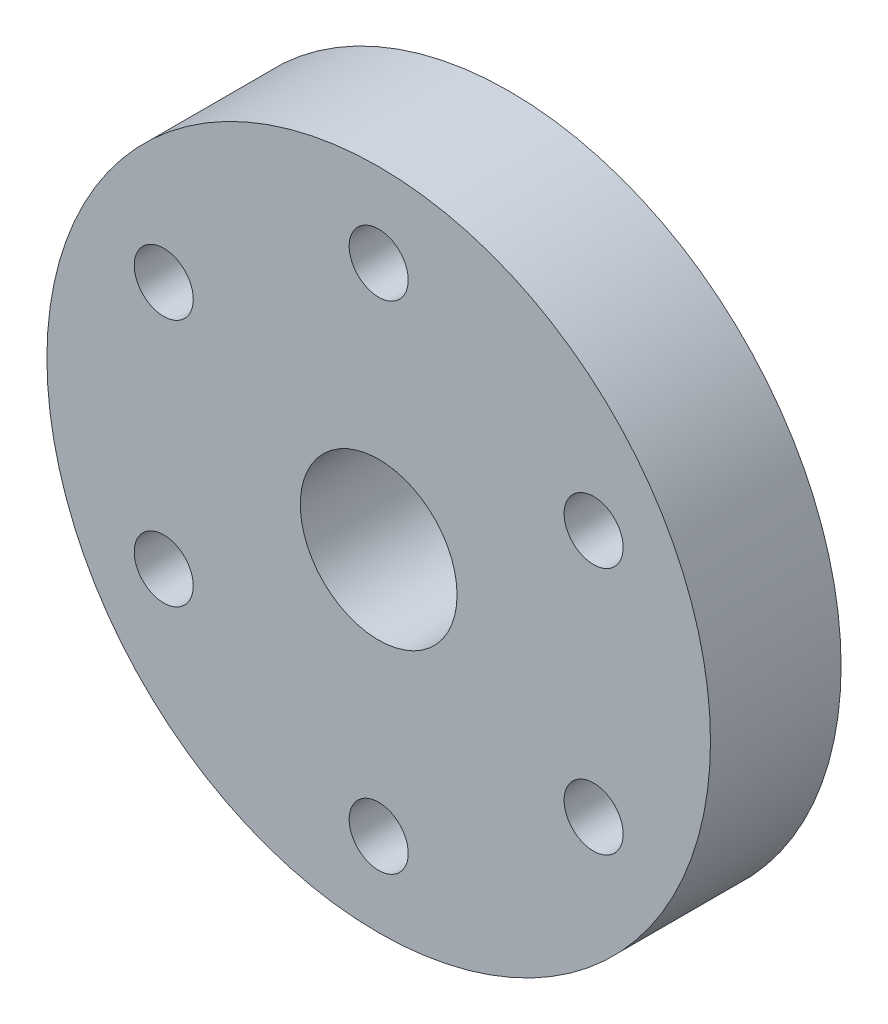
ISO-10303-21;
HEADER;
FILE_DESCRIPTION(('STEP AP214'),'2;1');
FILE_NAME('part.step','',(''),(''),'','','');
FILE_SCHEMA(('AUTOMOTIVE_DESIGN { 1 0 10303 214 1 1 1 1 }'));
ENDSEC;
DATA;
#1=APPLICATION_CONTEXT('core data for automotive mechanical design processes');
#2=APPLICATION_PROTOCOL_DEFINITION('international standard','automotive_design',2000,#1);
#3=PRODUCT_CONTEXT('',#1,'mechanical');
#4=PRODUCT('Part','Part','',(#3));
#5=PRODUCT_RELATED_PRODUCT_CATEGORY('part','',(#4));
#6=PRODUCT_DEFINITION_FORMATION('','',#4);
#7=PRODUCT_DEFINITION_CONTEXT('part definition',#1,'design');
#8=PRODUCT_DEFINITION('design','',#6,#7);
#9=PRODUCT_DEFINITION_SHAPE('','',#8);
#10=(LENGTH_UNIT() NAMED_UNIT(*) SI_UNIT(.MILLI.,.METRE.));
#11=(NAMED_UNIT(*) PLANE_ANGLE_UNIT() SI_UNIT($,.RADIAN.));
#12=(NAMED_UNIT(*) SI_UNIT($,.STERADIAN.) SOLID_ANGLE_UNIT());
#13=UNCERTAINTY_MEASURE_WITH_UNIT(LENGTH_MEASURE(1.E-05),#10,'distance_accuracy_value','');
#14=(GEOMETRIC_REPRESENTATION_CONTEXT(3) GLOBAL_UNCERTAINTY_ASSIGNED_CONTEXT((#13)) GLOBAL_UNIT_ASSIGNED_CONTEXT((#10,
#11,#12)) REPRESENTATION_CONTEXT('',''));
#15=CARTESIAN_POINT('',(0.,0.,0.));
#16=DIRECTION('',(0.,0.,1.));
#17=DIRECTION('',(1.,0.,0.));
#18=AXIS2_PLACEMENT_3D('',#15,#16,#17);
#19=CARTESIAN_POINT('',(0.,0.,0.));
#20=DIRECTION('',(0.,0.,1.));
#21=DIRECTION('',(1.,0.,0.));
#22=AXIS2_PLACEMENT_3D('',#19,#20,#21);
#23=PLANE('',#22);
#24=CARTESIAN_POINT('',(0.,0.,0.));
#25=DIRECTION('',(0.,0.,1.));
#26=DIRECTION('',(1.,0.,0.));
#27=AXIS2_PLACEMENT_3D('',#24,#25,#26);
#28=CIRCLE('',#27,6.);
#29=CARTESIAN_POINT('',(6.,0.,0.));
#30=VERTEX_POINT('',#29);
#31=EDGE_CURVE('E46',#30,#30,#28,.T.);
#32=ORIENTED_EDGE('',*,*,#31,.F.);
#33=EDGE_LOOP('',(#32));
#34=FACE_BOUND('',#33,.T.);
#35=CARTESIAN_POINT('',(0.,0.,0.));
#36=DIRECTION('',(0.,0.,1.));
#37=DIRECTION('',(1.,0.,0.));
#38=AXIS2_PLACEMENT_3D('',#35,#36,#37);
#39=CIRCLE('',#38,3.);
#40=CARTESIAN_POINT('',(3.,0.,0.));
#41=VERTEX_POINT('',#40);
#42=EDGE_CURVE('E51',#41,#41,#39,.T.);
#43=ORIENTED_EDGE('',*,*,#42,.T.);
#44=EDGE_LOOP('',(#43));
#45=FACE_BOUND('',#44,.T.);
#46=ADVANCED_FACE('F33',(#34,#45),#23,.F.);
#47=CARTESIAN_POINT('',(0.,0.,4.2));
#48=DIRECTION('',(0.,0.,-1.));
#49=DIRECTION('',(-1.,0.,0.));
#50=AXIS2_PLACEMENT_3D('',#47,#48,#49);
#51=CYLINDRICAL_SURFACE('',#50,6.);
#52=CARTESIAN_POINT('',(0.,-6.,3.5));
#53=CARTESIAN_POINT('',(0.0775136551808606,-5.99999860462077,3.49999755049782));
#54=CARTESIAN_POINT('',(0.155055852180418,-5.99848277720663,3.49354075895642));
#55=CARTESIAN_POINT('',(0.307928711689404,-5.99258245110673,3.46791633869285));
#56=CARTESIAN_POINT('',(0.383257908738774,-5.98819609437492,3.44874047701852));
#57=CARTESIAN_POINT('',(0.529474135819814,-5.97704189804572,3.39831831024663));
#58=CARTESIAN_POINT('',(0.600366020559867,-5.97027671664972,3.3670854743364));
#59=CARTESIAN_POINT('',(0.735902456221209,-5.95509063862421,3.29348083405209));
#60=CARTESIAN_POINT('',(0.800546997673411,-5.94666973948518,3.25110901279503));
#61=CARTESIAN_POINT('',(0.922925959248793,-5.92892044055307,3.15561764001887));
#62=CARTESIAN_POINT('',(0.980531045796356,-5.91957951935363,3.10233465382949));
#63=CARTESIAN_POINT('',(1.08607323847069,-5.90112886617325,2.98688389689762));
#64=CARTESIAN_POINT('',(1.13400938392729,-5.89201915724322,2.92471524435569));
#65=CARTESIAN_POINT('',(1.21944051732307,-5.87493771504315,2.79227998295129));
#66=CARTESIAN_POINT('',(1.25679466710317,-5.86698196255307,2.72192027567549));
#67=CARTESIAN_POINT('',(1.31909703704768,-5.85329030120377,2.57570531126446));
#68=CARTESIAN_POINT('',(1.34404696295362,-5.84755408715332,2.49985081137896));
#69=CARTESIAN_POINT('',(1.38039896443522,-5.83907906254273,2.34621138233285));
#70=CARTESIAN_POINT('',(1.39203167018675,-5.83628929295491,2.26848389510077));
#71=CARTESIAN_POINT('',(1.40213672759817,-5.83387021717826,2.11213439110955));
#72=CARTESIAN_POINT('',(1.40061093007045,-5.83424046651614,2.03351250170633));
#73=CARTESIAN_POINT('',(1.38462717006806,-5.83805360607404,1.87934410285429));
#74=CARTESIAN_POINT('',(1.37044019131594,-5.84143210805626,1.80376766136065));
#75=CARTESIAN_POINT('',(1.32996743878963,-5.85077891648779,1.65609814039352));
#76=CARTESIAN_POINT('',(1.30368090292846,-5.85674738606408,1.58400528064847));
#77=CARTESIAN_POINT('',(1.23951455308861,-5.87066310630364,1.44460351510235));
#78=CARTESIAN_POINT('',(1.20153320055199,-5.87862756950202,1.37734313734968));
#79=CARTESIAN_POINT('',(1.11512658099994,-5.89562771298769,1.25005155389481));
#80=CARTESIAN_POINT('',(1.06669970611106,-5.90466355809567,1.19002146336614));
#81=CARTESIAN_POINT('',(0.959356121021581,-5.92306231054005,1.07733750874245));
#82=CARTESIAN_POINT('',(0.900209750657103,-5.93242778207154,1.02490259657541));
#83=CARTESIAN_POINT('',(0.77385399055564,-5.95022809072843,0.93065747543382));
#84=CARTESIAN_POINT('',(0.706644412992491,-5.95866290616613,0.888847514030046));
#85=CARTESIAN_POINT('',(0.565782506984416,-5.97368513329122,0.816973308242645));
#86=CARTESIAN_POINT('',(0.492113392403213,-5.98026753264178,0.786940847183003));
#87=CARTESIAN_POINT('',(0.340585615176868,-5.99080645286014,0.739744288534925));
#88=CARTESIAN_POINT('',(0.262727650306185,-5.99476340961636,0.72257805477302));
#89=CARTESIAN_POINT('',(0.106907588460029,-5.99954244402773,0.70192686366759));
#90=CARTESIAN_POINT('',(0.0289871166552413,-6.00043294383207,0.698143245718862));
#91=CARTESIAN_POINT('',(-0.126372845528744,-5.99917188382708,0.703550834630745));
#92=CARTESIAN_POINT('',(-0.203812372830682,-5.99702056051609,0.7127410327916));
#93=CARTESIAN_POINT('',(-0.355000856153422,-5.98996106858808,0.74358830502789));
#94=CARTESIAN_POINT('',(-0.428784148664062,-5.9850881879476,0.765085887975081));
#95=CARTESIAN_POINT('',(-0.571695899544112,-5.97313240187964,0.819758347367704));
#96=CARTESIAN_POINT('',(-0.640823925050002,-5.96604929128103,0.852934307929705));
#97=CARTESIAN_POINT('',(-0.773676865632761,-5.95029195840437,0.930624301545468));
#98=CARTESIAN_POINT('',(-0.837298480893235,-5.9415942435686,0.975310106522388));
#99=CARTESIAN_POINT('',(-0.956246790292011,-5.92361520942204,1.07452818776419));
#100=CARTESIAN_POINT('',(-1.01157224539757,-5.91433380323009,1.1290619321447));
#101=CARTESIAN_POINT('',(-1.11356143853837,-5.89599253653189,1.24780629554065));
#102=CARTESIAN_POINT('',(-1.16001705897302,-5.8869415232112,1.31219730279702));
#103=CARTESIAN_POINT('',(-1.24145867752415,-5.87030791238069,1.44804081164209));
#104=CARTESIAN_POINT('',(-1.27644518731706,-5.8627252493689,1.51949299802219));
#105=CARTESIAN_POINT('',(-1.33370534540389,-5.84996505463622,1.66704045999628));
#106=CARTESIAN_POINT('',(-1.35605325740337,-5.84477350703676,1.74310564180338));
#107=CARTESIAN_POINT('',(-1.38761099409425,-5.83736270589205,1.89805048375049));
#108=CARTESIAN_POINT('',(-1.39682325969457,-5.83514290013266,1.97692961819947));
#109=CARTESIAN_POINT('',(-1.40173339100697,-5.8339650668052,2.1331565495));
#110=CARTESIAN_POINT('',(-1.39776234943619,-5.83492712585111,2.21049351644876));
#111=CARTESIAN_POINT('',(-1.3771667082819,-5.83982206816926,2.36336303979087));
#112=CARTESIAN_POINT('',(-1.36054230260668,-5.84375490591537,2.43889562381744));
#113=CARTESIAN_POINT('',(-1.31528151618139,-5.85410673416447,2.58570549046038));
#114=CARTESIAN_POINT('',(-1.28669962480293,-5.86051443684696,2.65700042145178));
#115=CARTESIAN_POINT('',(-1.2183798684127,-5.87509704008543,2.79382999595179));
#116=CARTESIAN_POINT('',(-1.17864066141223,-5.88327215319622,2.85936394529051));
#117=CARTESIAN_POINT('',(-1.08806343467475,-5.90070227653374,2.98442910308178));
#118=CARTESIAN_POINT('',(-1.03699221748307,-5.9099777197338,3.04378860408992));
#119=CARTESIAN_POINT('',(-0.925665237986201,-5.92843331002946,3.15320306160817));
#120=CARTESIAN_POINT('',(-0.865407334621453,-5.93761343437582,3.20325584303191));
#121=CARTESIAN_POINT('',(-0.736311376134255,-5.95501024549108,3.29337181261718));
#122=CARTESIAN_POINT('',(-0.667356718680486,-5.96321014750897,3.33327141389703));
#123=CARTESIAN_POINT('',(-0.523538263687533,-5.97755068140178,3.40084956861957));
#124=CARTESIAN_POINT('',(-0.448679156038939,-5.98369292771758,3.42853770862458));
#125=CARTESIAN_POINT('',(-0.311528184180862,-5.99221392489556,3.46634021560558));
#126=CARTESIAN_POINT('',(-0.249940948576286,-5.99511474612675,3.47893714788107));
#127=CARTESIAN_POINT('',(-0.125575340933341,-5.99900829461443,3.49576779433718));
#128=CARTESIAN_POINT('',(-0.0627970368842883,-6.00000113045477,3.50000198444363));
#129=CARTESIAN_POINT('',(0.,-6.,3.5));
#130=B_SPLINE_CURVE_WITH_KNOTS('',3,(#52,#53,#54,#55,#56,#57,#58,#59,#60,#61,#62,#63,#64,#65,
#66,#67,#68,#69,#70,#71,#72,#73,#74,#75,#76,#77,#78,#79,#80,#81,#82,#83,#84,#85,#86,#87,#88,#89,
#90,#91,#92,#93,#94,#95,#96,#97,#98,#99,#100,#101,#102,#103,#104,#105,#106,#107,#108,#109,#110,
#111,#112,#113,#114,#115,#116,#117,#118,#119,#120,#121,#122,#123,#124,#125,#126,#127,#128,#129),
.UNSPECIFIED.,.T.,.F.,(4,2,2,2,2,2,2,2,2,2,2,2,2,2,2,2,2,2,2,2,2,2,2,2,2,2,2,2,2,2,2,2,2,2,2,2,
2,2,4),(0.,0.232310985919359,0.464772491816953,0.696975056396176,0.929177972918811,
1.16515351438317,1.4011524899667,1.64015884953452,1.87913233353337,2.11390145918228,
2.34863756386325,2.57846705193038,2.8083110177202,3.04020969694585,3.27214409771247,
3.50981031406085,3.74748206773496,3.98579087118959,4.22406009957936,4.45697708738846,
4.68987596715844,4.9198229082951,5.14979120128962,5.38341339123567,5.61707043801289,
5.85567302562694,6.09426496691076,6.33143998718595,6.5685709290746,6.79979193674362,
7.03100940110476,7.2611845077494,7.49138731145205,7.72685864048367,7.9623849328642,
8.20149492533847,8.44041686981216,8.62863237610634,8.81683717069852),.UNSPECIFIED.);
#131=CARTESIAN_POINT('',(0.,-6.,3.5));
#132=VERTEX_POINT('',#131);
#133=EDGE_CURVE('E64',#132,#132,#130,.T.);
#134=ORIENTED_EDGE('',*,*,#133,.T.);
#135=EDGE_LOOP('',(#134));
#136=FACE_BOUND('',#135,.T.);
#137=CARTESIAN_POINT('',(0.,0.,4.2));
#138=DIRECTION('',(0.,0.,1.));
#139=DIRECTION('',(1.,0.,0.));
#140=AXIS2_PLACEMENT_3D('',#137,#138,#139);
#141=CIRCLE('',#140,6.);
#142=CARTESIAN_POINT('',(6.,0.,4.2));
#143=VERTEX_POINT('',#142);
#144=EDGE_CURVE('E10',#143,#143,#141,.T.);
#145=ORIENTED_EDGE('',*,*,#144,.F.);
#146=EDGE_LOOP('',(#145));
#147=FACE_BOUND('',#146,.T.);
#148=ORIENTED_EDGE('',*,*,#31,.T.);
#149=EDGE_LOOP('',(#148));
#150=FACE_BOUND('',#149,.T.);
#151=ADVANCED_FACE('F35',(#136,#147,#150),#51,.T.);
#152=CARTESIAN_POINT('',(0.,0.,4.2));
#153=DIRECTION('',(0.,0.,-1.));
#154=DIRECTION('',(-1.,0.,0.));
#155=AXIS2_PLACEMENT_3D('',#152,#153,#154);
#156=CYLINDRICAL_SURFACE('',#155,3.);
#157=CARTESIAN_POINT('',(0.,-3.,3.5));
#158=CARTESIAN_POINT('',(0.074176014195853,-2.9999965985567,3.49999594944587));
#159=CARTESIAN_POINT('',(0.148457438343158,-2.99721866421499,3.49407017916472));
#160=CARTESIAN_POINT('',(0.294860958042639,-2.98638133101226,3.47061224072665));
#161=CARTESIAN_POINT('',(0.366977899485661,-2.97831023303417,3.45305436203902));
#162=CARTESIAN_POINT('',(0.506705207958354,-2.95773878056305,3.40714824486611));
#163=CARTESIAN_POINT('',(0.574331184032727,-2.94525483671525,3.37883995676572));
#164=CARTESIAN_POINT('',(0.703790652559756,-2.91703179641225,3.3124256993013));
#165=CARTESIAN_POINT('',(0.765625113804207,-2.90129324579851,3.27432137260479));
#166=CARTESIAN_POINT('',(0.885556018232679,-2.86703510505487,3.18700931632246));
#167=CARTESIAN_POINT('',(0.943262854198595,-2.84841047078529,3.13730816073342));
#168=CARTESIAN_POINT('',(1.04987206669058,-2.81086626705385,3.02926581284594));
#169=CARTESIAN_POINT('',(1.09876864666266,-2.79194651225135,2.97091897793868));
#170=CARTESIAN_POINT('',(1.18954928643585,-2.75454886272565,2.84265632770077));
#171=CARTESIAN_POINT('',(1.23076801131511,-2.73618026181933,2.77223417349252));
#172=CARTESIAN_POINT('',(1.30060459631542,-2.70368671328044,2.62449166583378));
#173=CARTESIAN_POINT('',(1.32923050054668,-2.68955905843085,2.54717575409304));
#174=CARTESIAN_POINT('',(1.37136389166292,-2.66831280778357,2.3922913308142));
#175=CARTESIAN_POINT('',(1.38562630954338,-2.66084688805232,2.31497798660206));
#176=CARTESIAN_POINT('',(1.4009643178012,-2.65280653141493,2.1587238445313));
#177=CARTESIAN_POINT('',(1.4020501890138,-2.65222672171534,2.07978436362683));
#178=CARTESIAN_POINT('',(1.39156325474428,-2.6577381391041,1.93104782259268));
#179=CARTESIAN_POINT('',(1.38125548710099,-2.66316277668237,1.86113132367479));
#180=CARTESIAN_POINT('',(1.35043639237287,-2.67892103840313,1.72416592160718));
#181=CARTESIAN_POINT('',(1.32992244300339,-2.68925592410991,1.65711776023274));
#182=CARTESIAN_POINT('',(1.27887161255287,-2.71390923378543,1.52592780866886));
#183=CARTESIAN_POINT('',(1.24811450695909,-2.7283140240837,1.46188869599852));
#184=CARTESIAN_POINT('',(1.17761205733664,-2.75947702819645,1.33959400364931));
#185=CARTESIAN_POINT('',(1.13786278548149,-2.77623626923161,1.28134096740936));
#186=CARTESIAN_POINT('',(1.04545769592096,-2.81242518177222,1.16561325724133));
#187=CARTESIAN_POINT('',(0.991869135627384,-2.83194722846672,1.10890981132952));
#188=CARTESIAN_POINT('',(0.875809338201001,-2.86996272516678,1.00499883889947));
#189=CARTESIAN_POINT('',(0.813334864133948,-2.88845579691007,0.957794787991446));
#190=CARTESIAN_POINT('',(0.678420066791913,-2.92314231667083,0.872674741990081));
#191=CARTESIAN_POINT('',(0.605704043903011,-2.9392303997136,0.835149439534242));
#192=CARTESIAN_POINT('',(0.454047875045107,-2.9664385628126,0.773147281488888));
#193=CARTESIAN_POINT('',(0.375112098848906,-2.97756209480586,0.748661357101825));
#194=CARTESIAN_POINT('',(0.219630179590064,-2.99289168727817,0.715224614513687));
#195=CARTESIAN_POINT('',(0.143350867486889,-2.99755511855446,0.70524384224663));
#196=CARTESIAN_POINT('',(-0.00993159603062645,-3.00096130674055,0.697936660080451));
#197=CARTESIAN_POINT('',(-0.0869344549310046,-2.99970636153703,0.700605338869388));
#198=CARTESIAN_POINT('',(-0.234138662301146,-2.99169876992405,0.717859772256281));
#199=CARTESIAN_POINT('',(-0.304455247280262,-2.98531143610107,0.731653879274028));
#200=CARTESIAN_POINT('',(-0.441661374952198,-2.9681169868393,0.769585296470063));
#201=CARTESIAN_POINT('',(-0.508550515457683,-2.95730935403885,0.793723817397478));
#202=CARTESIAN_POINT('',(-0.639346310572959,-2.93186182190092,0.852389399888318));
#203=CARTESIAN_POINT('',(-0.703098749779368,-2.91711463217098,0.887212149985572));
#204=CARTESIAN_POINT('',(-0.824081336424187,-2.88527461622476,0.965934427053035));
#205=CARTESIAN_POINT('',(-0.881308600637792,-2.86818076040266,1.00983794254021));
#206=CARTESIAN_POINT('',(-0.992927203863406,-2.83157928041133,1.10995057808188));
#207=CARTESIAN_POINT('',(-1.04662821994276,-2.81199150907127,1.16690174669527));
#208=CARTESIAN_POINT('',(-1.14397488618524,-2.7738171204936,1.28917794714694));
#209=CARTESIAN_POINT('',(-1.18761573536873,-2.7552309844915,1.35450695406384));
#210=CARTESIAN_POINT('',(-1.26487258942864,-2.72065279755534,1.4944537387633));
#211=CARTESIAN_POINT('',(-1.29811762077689,-2.70476441122083,1.5693040329686));
#212=CARTESIAN_POINT('',(-1.35119476914698,-2.67864935946574,1.7245260622962));
#213=CARTESIAN_POINT('',(-1.37104172650419,-2.6684164320798,1.80489157939704));
#214=CARTESIAN_POINT('',(-1.39512361569359,-2.65589863089785,1.96107554771441));
#215=CARTESIAN_POINT('',(-1.40060458275626,-2.65298045006346,2.03665086073106));
#216=CARTESIAN_POINT('',(-1.39928993042139,-2.65367487263324,2.18765382327));
#217=CARTESIAN_POINT('',(-1.39249775922279,-2.65728564169681,2.26308150830889));
#218=CARTESIAN_POINT('',(-1.36795238910772,-2.66999487603889,2.40590006248366));
#219=CARTESIAN_POINT('',(-1.35103435582632,-2.67867409395688,2.47347595929578));
#220=CARTESIAN_POINT('',(-1.30765598987226,-2.70011439829818,2.60479828460279));
#221=CARTESIAN_POINT('',(-1.28119281477063,-2.71287670048705,2.66854356578271));
#222=CARTESIAN_POINT('',(-1.21748406199402,-2.74208602331761,2.7950365450524));
#223=CARTESIAN_POINT('',(-1.1796403806501,-2.75872111955289,2.85743847762141));
#224=CARTESIAN_POINT('',(-1.0949742620724,-2.79340714138716,2.97538981444124));
#225=CARTESIAN_POINT('',(-1.04814763276814,-2.81145872568485,3.03093599935386));
#226=CARTESIAN_POINT('',(-0.941307680520032,-2.8491150891186,3.13937361999567));
#227=CARTESIAN_POINT('',(-0.880442612871034,-2.86869394428718,3.1914392587178));
#228=CARTESIAN_POINT('',(-0.750199086477079,-2.90547332461736,3.28474343285123));
#229=CARTESIAN_POINT('',(-0.680816600685456,-2.92267271652822,3.32597681760483));
#230=CARTESIAN_POINT('',(-0.535611024288787,-2.95272548252542,3.39598749798326));
#231=CARTESIAN_POINT('',(-0.459824309977941,-2.96560157678301,3.42483014166356));
#232=CARTESIAN_POINT('',(-0.303822742627249,-2.98560363061672,3.46902274354933));
#233=CARTESIAN_POINT('',(-0.223621832238217,-2.99274669700571,3.48441285517442));
#234=CARTESIAN_POINT('',(-0.118989792805177,-2.99773444736987,3.49513901457568));
#235=CARTESIAN_POINT('',(-0.0952397688918332,-2.99858232619917,3.49695990001916));
#236=CARTESIAN_POINT('',(-0.047663459625105,-2.99971565466794,3.49939105564999));
#237=CARTESIAN_POINT('',(-0.0238371727597297,-3.00000109308639,3.50000130168437));
#238=CARTESIAN_POINT('',(0.,-3.,3.5));
#239=B_SPLINE_CURVE_WITH_KNOTS('',3,(#157,#158,#159,#160,#161,#162,#163,#164,#165,#166,#167,
#168,#169,#170,#171,#172,#173,#174,#175,#176,#177,#178,#179,#180,#181,#182,#183,#184,#185,#186,
#187,#188,#189,#190,#191,#192,#193,#194,#195,#196,#197,#198,#199,#200,#201,#202,#203,#204,#205,
#206,#207,#208,#209,#210,#211,#212,#213,#214,#215,#216,#217,#218,#219,#220,#221,#222,#223,#224,
#225,#226,#227,#228,#229,#230,#231,#232,#233,#234,#235,#236,#237,#238),.UNSPECIFIED.,.T.,.F.,(4,
2,2,2,2,2,2,2,2,2,2,2,2,2,2,2,2,2,2,2,2,2,2,2,2,2,2,2,2,2,2,2,2,2,2,2,2,2,2,2,4),(0.,
0.222430614227101,0.445354516020344,0.667457974459496,0.889524213319483,1.12374008349084,
1.3581094936473,1.60776429290693,1.8572593839249,2.09282314699248,2.32820310256044,
2.53985531348055,2.75156193252273,2.96815060600377,3.18483406988205,3.42504393482463,
3.66534152788207,3.91419776760519,4.16288070273416,4.392858842168,4.62274769694935,
4.83758576938905,5.05244899415581,5.27389671638204,5.49544191175845,5.73644174754948,
5.97755635787823,6.2264897623231,6.47514698203737,6.70138965858241,6.92756878101077,
7.13725924988263,7.34701221368888,7.57065894835865,7.79441030722339,8.0406156991707,
8.28693794895593,8.53194466707524,8.7762175616393,8.84769634435319,8.9191765530954),.UNSPECIFIED.);
#240=CARTESIAN_POINT('',(0.,-3.,3.5));
#241=VERTEX_POINT('',#240);
#242=EDGE_CURVE('E38',#241,#241,#239,.T.);
#243=ORIENTED_EDGE('',*,*,#242,.F.);
#244=EDGE_LOOP('',(#243));
#245=FACE_BOUND('',#244,.T.);
#246=ORIENTED_EDGE('',*,*,#42,.F.);
#247=EDGE_LOOP('',(#246));
#248=FACE_BOUND('',#247,.T.);
#249=CARTESIAN_POINT('',(0.,0.,9.2));
#250=DIRECTION('',(0.,0.,1.));
#251=DIRECTION('',(1.,0.,0.));
#252=AXIS2_PLACEMENT_3D('',#249,#250,#251);
#253=CIRCLE('',#252,3.);
#254=CARTESIAN_POINT('',(3.,0.,9.2));
#255=VERTEX_POINT('',#254);
#256=EDGE_CURVE('E59',#255,#255,#253,.T.);
#257=ORIENTED_EDGE('',*,*,#256,.T.);
#258=EDGE_LOOP('',(#257));
#259=FACE_BOUND('',#258,.T.);
#260=ADVANCED_FACE('F88',(#245,#248,#259),#156,.F.);
#261=CARTESIAN_POINT('',(0.,0.,4.2));
#262=DIRECTION('',(0.,0.,1.));
#263=DIRECTION('',(1.,0.,0.));
#264=AXIS2_PLACEMENT_3D('',#261,#262,#263);
#265=PLANE('',#264);
#266=CARTESIAN_POINT('',(-8.22724133595156,-4.75000000000035,4.2));
#267=DIRECTION('',(0.,0.,1.));
#268=DIRECTION('',(1.,0.,0.));
#269=AXIS2_PLACEMENT_3D('',#266,#267,#268);
#270=CIRCLE('',#269,1.13029999999999);
#271=CARTESIAN_POINT('',(-7.09694133595157,-4.75000000000035,4.2));
#272=VERTEX_POINT('',#271);
#273=EDGE_CURVE('E230',#272,#272,#270,.T.);
#274=ORIENTED_EDGE('',*,*,#273,.T.);
#275=EDGE_LOOP('',(#274));
#276=FACE_BOUND('',#275,.T.);
#277=CARTESIAN_POINT('',(-8.22724133595197,4.74999999999964,4.2));
#278=DIRECTION('',(0.,0.,1.));
#279=DIRECTION('',(1.,0.,0.));
#280=AXIS2_PLACEMENT_3D('',#277,#278,#279);
#281=CIRCLE('',#280,1.13029999999999);
#282=CARTESIAN_POINT('',(-7.09694133595198,4.74999999999964,4.2));
#283=VERTEX_POINT('',#282);
#284=EDGE_CURVE('E234',#283,#283,#281,.T.);
#285=ORIENTED_EDGE('',*,*,#284,.T.);
#286=EDGE_LOOP('',(#285));
#287=FACE_BOUND('',#286,.T.);
#288=CARTESIAN_POINT('',(0.,9.5,4.2));
#289=DIRECTION('',(0.,0.,1.));
#290=DIRECTION('',(1.,0.,0.));
#291=AXIS2_PLACEMENT_3D('',#288,#289,#290);
#292=CIRCLE('',#291,1.13029999999999);
#293=CARTESIAN_POINT('',(1.13029999999999,9.5,4.2));
#294=VERTEX_POINT('',#293);
#295=EDGE_CURVE('E243',#294,#294,#292,.T.);
#296=ORIENTED_EDGE('',*,*,#295,.T.);
#297=EDGE_LOOP('',(#296));
#298=FACE_BOUND('',#297,.T.);
#299=CARTESIAN_POINT('',(8.22724133595237,4.75000000000035,4.2));
#300=DIRECTION('',(0.,0.,1.));
#301=DIRECTION('',(1.,0.,0.));
#302=AXIS2_PLACEMENT_3D('',#299,#300,#301);
#303=CIRCLE('',#302,1.13029999999999);
#304=CARTESIAN_POINT('',(9.35754133595236,4.75000000000035,4.2));
#305=VERTEX_POINT('',#304);
#306=EDGE_CURVE('E249',#305,#305,#303,.T.);
#307=ORIENTED_EDGE('',*,*,#306,.T.);
#308=EDGE_LOOP('',(#307));
#309=FACE_BOUND('',#308,.T.);
#310=CARTESIAN_POINT('',(8.22724133595277,-4.74999999999965,4.2));
#311=DIRECTION('',(0.,0.,1.));
#312=DIRECTION('',(1.,0.,0.));
#313=AXIS2_PLACEMENT_3D('',#310,#311,#312);
#314=CIRCLE('',#313,1.13029999999999);
#315=CARTESIAN_POINT('',(9.35754133595276,-4.74999999999965,4.2));
#316=VERTEX_POINT('',#315);
#317=EDGE_CURVE('E255',#316,#316,#314,.T.);
#318=ORIENTED_EDGE('',*,*,#317,.T.);
#319=EDGE_LOOP('',(#318));
#320=FACE_BOUND('',#319,.T.);
#321=CARTESIAN_POINT('',(8.07691889848134E-13,-9.5,4.2));
#322=DIRECTION('',(0.,0.,1.));
#323=DIRECTION('',(1.,0.,0.));
#324=AXIS2_PLACEMENT_3D('',#321,#322,#323);
#325=CIRCLE('',#324,1.13029999999999);
#326=CARTESIAN_POINT('',(1.1303000000008,-9.5,4.2));
#327=VERTEX_POINT('',#326);
#328=EDGE_CURVE('E69',#327,#327,#325,.T.);
#329=ORIENTED_EDGE('',*,*,#328,.T.);
#330=EDGE_LOOP('',(#329));
#331=FACE_BOUND('',#330,.T.);
#332=CARTESIAN_POINT('',(0.,0.,4.2));
#333=DIRECTION('',(0.,0.,1.));
#334=DIRECTION('',(1.,0.,0.));
#335=AXIS2_PLACEMENT_3D('',#332,#333,#334);
#336=CIRCLE('',#335,12.7);
#337=CARTESIAN_POINT('',(12.7,0.,4.2));
#338=VERTEX_POINT('',#337);
#339=EDGE_CURVE('E56',#338,#338,#336,.T.);
#340=ORIENTED_EDGE('',*,*,#339,.F.);
#341=EDGE_LOOP('',(#340));
#342=FACE_BOUND('',#341,.T.);
#343=ORIENTED_EDGE('',*,*,#144,.T.);
#344=EDGE_LOOP('',(#343));
#345=FACE_BOUND('',#344,.T.);
#346=ADVANCED_FACE('F84',(#276,#287,#298,#309,#320,#331,#342,#345),#265,.F.);
#347=CARTESIAN_POINT('',(0.,0.,9.2));
#348=DIRECTION('',(0.,0.,1.));
#349=DIRECTION('',(1.,0.,0.));
#350=AXIS2_PLACEMENT_3D('',#347,#348,#349);
#351=PLANE('',#350);
#352=CARTESIAN_POINT('',(-8.22724133595156,-4.75000000000035,9.2));
#353=DIRECTION('',(0.,0.,1.));
#354=DIRECTION('',(1.,0.,0.));
#355=AXIS2_PLACEMENT_3D('',#352,#353,#354);
#356=CIRCLE('',#355,1.13029999999999);
#357=CARTESIAN_POINT('',(-7.09694133595157,-4.75000000000035,9.2));
#358=VERTEX_POINT('',#357);
#359=EDGE_CURVE('E227',#358,#358,#356,.T.);
#360=ORIENTED_EDGE('',*,*,#359,.F.);
#361=EDGE_LOOP('',(#360));
#362=FACE_BOUND('',#361,.T.);
#363=CARTESIAN_POINT('',(-8.22724133595197,4.74999999999964,9.2));
#364=DIRECTION('',(0.,0.,1.));
#365=DIRECTION('',(1.,0.,0.));
#366=AXIS2_PLACEMENT_3D('',#363,#364,#365);
#367=CIRCLE('',#366,1.13029999999999);
#368=CARTESIAN_POINT('',(-7.09694133595198,4.74999999999964,9.2));
#369=VERTEX_POINT('',#368);
#370=EDGE_CURVE('E231',#369,#369,#367,.T.);
#371=ORIENTED_EDGE('',*,*,#370,.F.);
#372=EDGE_LOOP('',(#371));
#373=FACE_BOUND('',#372,.T.);
#374=CARTESIAN_POINT('',(0.,9.5,9.2));
#375=DIRECTION('',(0.,0.,1.));
#376=DIRECTION('',(1.,0.,0.));
#377=AXIS2_PLACEMENT_3D('',#374,#375,#376);
#378=CIRCLE('',#377,1.13029999999999);
#379=CARTESIAN_POINT('',(1.13029999999999,9.5,9.2));
#380=VERTEX_POINT('',#379);
#381=EDGE_CURVE('E240',#380,#380,#378,.T.);
#382=ORIENTED_EDGE('',*,*,#381,.F.);
#383=EDGE_LOOP('',(#382));
#384=FACE_BOUND('',#383,.T.);
#385=CARTESIAN_POINT('',(8.22724133595237,4.75000000000035,9.2));
#386=DIRECTION('',(0.,0.,1.));
#387=DIRECTION('',(1.,0.,0.));
#388=AXIS2_PLACEMENT_3D('',#385,#386,#387);
#389=CIRCLE('',#388,1.13029999999999);
#390=CARTESIAN_POINT('',(9.35754133595236,4.75000000000035,9.2));
#391=VERTEX_POINT('',#390);
#392=EDGE_CURVE('E246',#391,#391,#389,.T.);
#393=ORIENTED_EDGE('',*,*,#392,.F.);
#394=EDGE_LOOP('',(#393));
#395=FACE_BOUND('',#394,.T.);
#396=CARTESIAN_POINT('',(8.22724133595277,-4.74999999999965,9.2));
#397=DIRECTION('',(0.,0.,1.));
#398=DIRECTION('',(1.,0.,0.));
#399=AXIS2_PLACEMENT_3D('',#396,#397,#398);
#400=CIRCLE('',#399,1.13029999999999);
#401=CARTESIAN_POINT('',(9.35754133595276,-4.74999999999965,9.2));
#402=VERTEX_POINT('',#401);
#403=EDGE_CURVE('E252',#402,#402,#400,.T.);
#404=ORIENTED_EDGE('',*,*,#403,.F.);
#405=EDGE_LOOP('',(#404));
#406=FACE_BOUND('',#405,.T.);
#407=CARTESIAN_POINT('',(8.07691889848134E-13,-9.5,9.2));
#408=DIRECTION('',(0.,0.,1.));
#409=DIRECTION('',(1.,0.,0.));
#410=AXIS2_PLACEMENT_3D('',#407,#408,#409);
#411=CIRCLE('',#410,1.13029999999999);
#412=CARTESIAN_POINT('',(1.1303000000008,-9.5,9.2));
#413=VERTEX_POINT('',#412);
#414=EDGE_CURVE('E257',#413,#413,#411,.T.);
#415=ORIENTED_EDGE('',*,*,#414,.F.);
#416=EDGE_LOOP('',(#415));
#417=FACE_BOUND('',#416,.T.);
#418=CARTESIAN_POINT('',(0.,0.,9.2));
#419=DIRECTION('',(0.,0.,1.));
#420=DIRECTION('',(1.,0.,0.));
#421=AXIS2_PLACEMENT_3D('',#418,#419,#420);
#422=CIRCLE('',#421,12.7);
#423=CARTESIAN_POINT('',(12.7,0.,9.2));
#424=VERTEX_POINT('',#423);
#425=EDGE_CURVE('E55',#424,#424,#422,.T.);
#426=ORIENTED_EDGE('',*,*,#425,.T.);
#427=EDGE_LOOP('',(#426));
#428=FACE_BOUND('',#427,.T.);
#429=ORIENTED_EDGE('',*,*,#256,.F.);
#430=EDGE_LOOP('',(#429));
#431=FACE_BOUND('',#430,.T.);
#432=ADVANCED_FACE('F80',(#362,#373,#384,#395,#406,#417,#428,#431),#351,.T.);
#433=CARTESIAN_POINT('',(0.,0.,9.2));
#434=DIRECTION('',(0.,0.,-1.));
#435=DIRECTION('',(-1.,0.,0.));
#436=AXIS2_PLACEMENT_3D('',#433,#434,#435);
#437=CYLINDRICAL_SURFACE('',#436,12.7);
#438=ORIENTED_EDGE('',*,*,#425,.F.);
#439=EDGE_LOOP('',(#438));
#440=FACE_BOUND('',#439,.T.);
#441=ORIENTED_EDGE('',*,*,#339,.T.);
#442=EDGE_LOOP('',(#441));
#443=FACE_BOUND('',#442,.T.);
#444=ADVANCED_FACE('F77',(#440,#443),#437,.T.);
#445=CARTESIAN_POINT('',(0.,-12.7,2.1));
#446=DIRECTION('',(0.,1.,0.));
#447=DIRECTION('',(0.,0.,1.));
#448=AXIS2_PLACEMENT_3D('',#445,#446,#447);
#449=CYLINDRICAL_SURFACE('',#448,1.4);
#450=ORIENTED_EDGE('',*,*,#242,.T.);
#451=EDGE_LOOP('',(#450));
#452=FACE_BOUND('',#451,.T.);
#453=ORIENTED_EDGE('',*,*,#133,.F.);
#454=EDGE_LOOP('',(#453));
#455=FACE_BOUND('',#454,.T.);
#456=ADVANCED_FACE('F71',(#452,#455),#449,.F.);
#457=CARTESIAN_POINT('',(8.07691889848134E-13,-9.5,9.2));
#458=DIRECTION('',(0.,0.,1.));
#459=DIRECTION('',(1.,0.,0.));
#460=AXIS2_PLACEMENT_3D('',#457,#458,#459);
#461=CYLINDRICAL_SURFACE('',#460,1.13029999999999);
#462=ORIENTED_EDGE('',*,*,#414,.T.);
#463=EDGE_LOOP('',(#462));
#464=FACE_BOUND('',#463,.T.);
#465=ORIENTED_EDGE('',*,*,#328,.F.);
#466=EDGE_LOOP('',(#465));
#467=FACE_BOUND('',#466,.T.);
#468=ADVANCED_FACE('F76',(#464,#467),#461,.F.);
#469=CARTESIAN_POINT('',(8.22724133595277,-4.74999999999965,9.2));
#470=DIRECTION('',(0.,0.,1.));
#471=DIRECTION('',(1.,0.,0.));
#472=AXIS2_PLACEMENT_3D('',#469,#470,#471);
#473=CYLINDRICAL_SURFACE('',#472,1.13029999999999);
#474=ORIENTED_EDGE('',*,*,#403,.T.);
#475=EDGE_LOOP('',(#474));
#476=FACE_BOUND('',#475,.T.);
#477=ORIENTED_EDGE('',*,*,#317,.F.);
#478=EDGE_LOOP('',(#477));
#479=FACE_BOUND('',#478,.T.);
#480=ADVANCED_FACE('F141',(#476,#479),#473,.F.);
#481=CARTESIAN_POINT('',(8.22724133595237,4.75000000000035,9.2));
#482=DIRECTION('',(0.,0.,1.));
#483=DIRECTION('',(1.,0.,0.));
#484=AXIS2_PLACEMENT_3D('',#481,#482,#483);
#485=CYLINDRICAL_SURFACE('',#484,1.13029999999999);
#486=ORIENTED_EDGE('',*,*,#392,.T.);
#487=EDGE_LOOP('',(#486));
#488=FACE_BOUND('',#487,.T.);
#489=ORIENTED_EDGE('',*,*,#306,.F.);
#490=EDGE_LOOP('',(#489));
#491=FACE_BOUND('',#490,.T.);
#492=ADVANCED_FACE('F147',(#488,#491),#485,.F.);
#493=CARTESIAN_POINT('',(0.,9.5,9.2));
#494=DIRECTION('',(0.,0.,1.));
#495=DIRECTION('',(1.,0.,0.));
#496=AXIS2_PLACEMENT_3D('',#493,#494,#495);
#497=CYLINDRICAL_SURFACE('',#496,1.13029999999999);
#498=ORIENTED_EDGE('',*,*,#381,.T.);
#499=EDGE_LOOP('',(#498));
#500=FACE_BOUND('',#499,.T.);
#501=ORIENTED_EDGE('',*,*,#295,.F.);
#502=EDGE_LOOP('',(#501));
#503=FACE_BOUND('',#502,.T.);
#504=ADVANCED_FACE('F154',(#500,#503),#497,.F.);
#505=CARTESIAN_POINT('',(-8.22724133595197,4.74999999999964,9.2));
#506=DIRECTION('',(0.,0.,1.));
#507=DIRECTION('',(1.,0.,0.));
#508=AXIS2_PLACEMENT_3D('',#505,#506,#507);
#509=CYLINDRICAL_SURFACE('',#508,1.13029999999999);
#510=ORIENTED_EDGE('',*,*,#370,.T.);
#511=EDGE_LOOP('',(#510));
#512=FACE_BOUND('',#511,.T.);
#513=ORIENTED_EDGE('',*,*,#284,.F.);
#514=EDGE_LOOP('',(#513));
#515=FACE_BOUND('',#514,.T.);
#516=ADVANCED_FACE('F162',(#512,#515),#509,.F.);
#517=CARTESIAN_POINT('',(-8.22724133595156,-4.75000000000035,9.2));
#518=DIRECTION('',(0.,0.,1.));
#519=DIRECTION('',(1.,0.,0.));
#520=AXIS2_PLACEMENT_3D('',#517,#518,#519);
#521=CYLINDRICAL_SURFACE('',#520,1.13029999999999);
#522=ORIENTED_EDGE('',*,*,#359,.T.);
#523=EDGE_LOOP('',(#522));
#524=FACE_BOUND('',#523,.T.);
#525=ORIENTED_EDGE('',*,*,#273,.F.);
#526=EDGE_LOOP('',(#525));
#527=FACE_BOUND('',#526,.T.);
#528=ADVANCED_FACE('F170',(#524,#527),#521,.F.);
#529=CLOSED_SHELL('',(#46,#151,#260,#346,#432,#444,#456,#468,#480,#492,#504,#516,#528));
#530=MANIFOLD_SOLID_BREP('B2',#529);
#531=ADVANCED_BREP_SHAPE_REPRESENTATION('',(#18,#530),#14);
#532=SHAPE_DEFINITION_REPRESENTATION(#9,#531);
ENDSEC;
END-ISO-10303-21;
